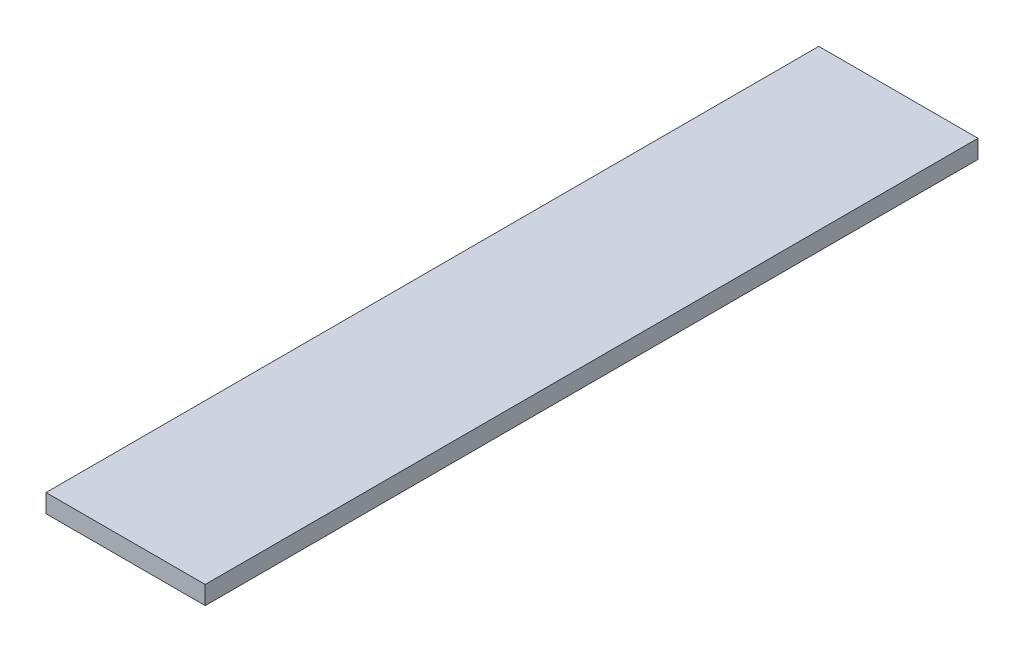
ISO-10303-21;
HEADER;
FILE_DESCRIPTION(('STEP AP214'),'2;1');
FILE_NAME('part.step','',(''),(''),'','','');
FILE_SCHEMA(('AUTOMOTIVE_DESIGN { 1 0 10303 214 1 1 1 1 }'));
ENDSEC;
DATA;
#1=APPLICATION_CONTEXT('core data for automotive mechanical design processes');
#2=APPLICATION_PROTOCOL_DEFINITION('international standard','automotive_design',2000,#1);
#3=PRODUCT_CONTEXT('',#1,'mechanical');
#4=PRODUCT('Part','Part','',(#3));
#5=PRODUCT_RELATED_PRODUCT_CATEGORY('part','',(#4));
#6=PRODUCT_DEFINITION_FORMATION('','',#4);
#7=PRODUCT_DEFINITION_CONTEXT('part definition',#1,'design');
#8=PRODUCT_DEFINITION('design','',#6,#7);
#9=PRODUCT_DEFINITION_SHAPE('','',#8);
#10=(LENGTH_UNIT() NAMED_UNIT(*) SI_UNIT(.MILLI.,.METRE.));
#11=(NAMED_UNIT(*) PLANE_ANGLE_UNIT() SI_UNIT($,.RADIAN.));
#12=(NAMED_UNIT(*) SI_UNIT($,.STERADIAN.) SOLID_ANGLE_UNIT());
#13=UNCERTAINTY_MEASURE_WITH_UNIT(LENGTH_MEASURE(1.E-05),#10,'distance_accuracy_value','');
#14=(GEOMETRIC_REPRESENTATION_CONTEXT(3) GLOBAL_UNCERTAINTY_ASSIGNED_CONTEXT((#13)) GLOBAL_UNIT_ASSIGNED_CONTEXT((#10,
#11,#12)) REPRESENTATION_CONTEXT('',''));
#15=CARTESIAN_POINT('',(0.,0.,0.));
#16=DIRECTION('',(0.,0.,1.));
#17=DIRECTION('',(1.,0.,0.));
#18=AXIS2_PLACEMENT_3D('',#15,#16,#17);
#19=CARTESIAN_POINT('',(0.,3.,0.));
#20=DIRECTION('',(1.,0.,0.));
#21=DIRECTION('',(0.,0.,-1.));
#22=AXIS2_PLACEMENT_3D('',#19,#20,#21);
#23=PLANE('',#22);
#24=DIRECTION('',(0.,0.,1.));
#25=VECTOR('',#24,1.);
#26=CARTESIAN_POINT('',(0.,0.,0.));
#27=LINE('',#26,#25);
#28=CARTESIAN_POINT('',(0.,0.,-126.2));
#29=VERTEX_POINT('',#28);
#30=CARTESIAN_POINT('',(0.,0.,0.));
#31=VERTEX_POINT('',#30);
#32=EDGE_CURVE('E99',#29,#31,#27,.T.);
#33=ORIENTED_EDGE('',*,*,#32,.T.);
#34=DIRECTION('',(0.,-1.,0.));
#35=VECTOR('',#34,1.);
#36=CARTESIAN_POINT('',(0.,3.,0.));
#37=LINE('',#36,#35);
#38=CARTESIAN_POINT('',(0.,3.,0.));
#39=VERTEX_POINT('',#38);
#40=EDGE_CURVE('E11',#39,#31,#37,.T.);
#41=ORIENTED_EDGE('',*,*,#40,.F.);
#42=DIRECTION('',(0.,0.,1.));
#43=VECTOR('',#42,1.);
#44=CARTESIAN_POINT('',(0.,3.,0.));
#45=LINE('',#44,#43);
#46=CARTESIAN_POINT('',(0.,3.,-126.2));
#47=VERTEX_POINT('',#46);
#48=EDGE_CURVE('E87',#47,#39,#45,.T.);
#49=ORIENTED_EDGE('',*,*,#48,.F.);
#50=DIRECTION('',(0.,-1.,0.));
#51=VECTOR('',#50,1.);
#52=CARTESIAN_POINT('',(0.,3.,-126.2));
#53=LINE('',#52,#51);
#54=EDGE_CURVE('E95',#47,#29,#53,.T.);
#55=ORIENTED_EDGE('',*,*,#54,.T.);
#56=EDGE_LOOP('',(#33,#41,#49,#55));
#57=FACE_BOUND('',#56,.T.);
#58=ADVANCED_FACE('F36',(#57),#23,.F.);
#59=CARTESIAN_POINT('',(0.,3.,0.));
#60=DIRECTION('',(0.,0.,-1.));
#61=DIRECTION('',(-1.,0.,0.));
#62=AXIS2_PLACEMENT_3D('',#59,#60,#61);
#63=PLANE('',#62);
#64=DIRECTION('',(1.,0.,0.));
#65=VECTOR('',#64,1.);
#66=CARTESIAN_POINT('',(0.,0.,0.));
#67=LINE('',#66,#65);
#68=CARTESIAN_POINT('',(26.,0.,0.));
#69=VERTEX_POINT('',#68);
#70=EDGE_CURVE('E91',#31,#69,#67,.T.);
#71=ORIENTED_EDGE('',*,*,#70,.T.);
#72=DIRECTION('',(0.,-1.,0.));
#73=VECTOR('',#72,1.);
#74=CARTESIAN_POINT('',(26.,3.,0.));
#75=LINE('',#74,#73);
#76=CARTESIAN_POINT('',(26.,3.,0.));
#77=VERTEX_POINT('',#76);
#78=EDGE_CURVE('E44',#77,#69,#75,.T.);
#79=ORIENTED_EDGE('',*,*,#78,.F.);
#80=DIRECTION('',(1.,0.,0.));
#81=VECTOR('',#80,1.);
#82=CARTESIAN_POINT('',(0.,3.,0.));
#83=LINE('',#82,#81);
#84=EDGE_CURVE('E82',#39,#77,#83,.T.);
#85=ORIENTED_EDGE('',*,*,#84,.F.);
#86=ORIENTED_EDGE('',*,*,#40,.T.);
#87=EDGE_LOOP('',(#71,#79,#85,#86));
#88=FACE_BOUND('',#87,.T.);
#89=ADVANCED_FACE('F90',(#88),#63,.F.);
#90=CARTESIAN_POINT('',(26.,3.,0.));
#91=DIRECTION('',(-1.,0.,0.));
#92=DIRECTION('',(0.,0.,1.));
#93=AXIS2_PLACEMENT_3D('',#90,#91,#92);
#94=PLANE('',#93);
#95=DIRECTION('',(0.,0.,-1.));
#96=VECTOR('',#95,1.);
#97=CARTESIAN_POINT('',(26.,0.,0.));
#98=LINE('',#97,#96);
#99=CARTESIAN_POINT('',(26.,0.,-126.2));
#100=VERTEX_POINT('',#99);
#101=EDGE_CURVE('E69',#69,#100,#98,.T.);
#102=ORIENTED_EDGE('',*,*,#101,.T.);
#103=DIRECTION('',(0.,-1.,0.));
#104=VECTOR('',#103,1.);
#105=CARTESIAN_POINT('',(26.,3.,-126.2));
#106=LINE('',#105,#104);
#107=CARTESIAN_POINT('',(26.,3.,-126.2));
#108=VERTEX_POINT('',#107);
#109=EDGE_CURVE('E92',#108,#100,#106,.T.);
#110=ORIENTED_EDGE('',*,*,#109,.F.);
#111=DIRECTION('',(0.,0.,-1.));
#112=VECTOR('',#111,1.);
#113=CARTESIAN_POINT('',(26.,3.,0.));
#114=LINE('',#113,#112);
#115=EDGE_CURVE('E85',#77,#108,#114,.T.);
#116=ORIENTED_EDGE('',*,*,#115,.F.);
#117=ORIENTED_EDGE('',*,*,#78,.T.);
#118=EDGE_LOOP('',(#102,#110,#116,#117));
#119=FACE_BOUND('',#118,.T.);
#120=ADVANCED_FACE('F93',(#119),#94,.F.);
#121=CARTESIAN_POINT('',(0.,3.,-126.2));
#122=DIRECTION('',(0.,0.,1.));
#123=DIRECTION('',(1.,0.,0.));
#124=AXIS2_PLACEMENT_3D('',#121,#122,#123);
#125=PLANE('',#124);
#126=DIRECTION('',(-1.,0.,0.));
#127=VECTOR('',#126,1.);
#128=CARTESIAN_POINT('',(0.,0.,-126.2));
#129=LINE('',#128,#127);
#130=EDGE_CURVE('E75',#100,#29,#129,.T.);
#131=ORIENTED_EDGE('',*,*,#130,.T.);
#132=ORIENTED_EDGE('',*,*,#54,.F.);
#133=DIRECTION('',(-1.,0.,0.));
#134=VECTOR('',#133,1.);
#135=CARTESIAN_POINT('',(0.,3.,-126.2));
#136=LINE('',#135,#134);
#137=EDGE_CURVE('E52',#108,#47,#136,.T.);
#138=ORIENTED_EDGE('',*,*,#137,.F.);
#139=ORIENTED_EDGE('',*,*,#109,.T.);
#140=EDGE_LOOP('',(#131,#132,#138,#139));
#141=FACE_BOUND('',#140,.T.);
#142=ADVANCED_FACE('F106',(#141),#125,.F.);
#143=CARTESIAN_POINT('',(0.,3.,0.));
#144=DIRECTION('',(0.,-1.,0.));
#145=DIRECTION('',(0.,0.,-1.));
#146=AXIS2_PLACEMENT_3D('',#143,#144,#145);
#147=PLANE('',#146);
#148=ORIENTED_EDGE('',*,*,#48,.T.);
#149=ORIENTED_EDGE('',*,*,#84,.T.);
#150=ORIENTED_EDGE('',*,*,#115,.T.);
#151=ORIENTED_EDGE('',*,*,#137,.T.);
#152=EDGE_LOOP('',(#148,#149,#150,#151));
#153=FACE_BOUND('',#152,.T.);
#154=ADVANCED_FACE('F83',(#153),#147,.F.);
#155=CARTESIAN_POINT('',(0.,0.,0.));
#156=DIRECTION('',(0.,-1.,0.));
#157=DIRECTION('',(0.,0.,-1.));
#158=AXIS2_PLACEMENT_3D('',#155,#156,#157);
#159=PLANE('',#158);
#160=ORIENTED_EDGE('',*,*,#32,.F.);
#161=ORIENTED_EDGE('',*,*,#130,.F.);
#162=ORIENTED_EDGE('',*,*,#101,.F.);
#163=ORIENTED_EDGE('',*,*,#70,.F.);
#164=EDGE_LOOP('',(#160,#161,#162,#163));
#165=FACE_BOUND('',#164,.T.);
#166=ADVANCED_FACE('F109',(#165),#159,.T.);
#167=CLOSED_SHELL('',(#58,#89,#120,#142,#154,#166));
#168=MANIFOLD_SOLID_BREP('B2',#167);
#169=ADVANCED_BREP_SHAPE_REPRESENTATION('',(#18,#168),#14);
#170=SHAPE_DEFINITION_REPRESENTATION(#9,#169);
ENDSEC;
END-ISO-10303-21;
